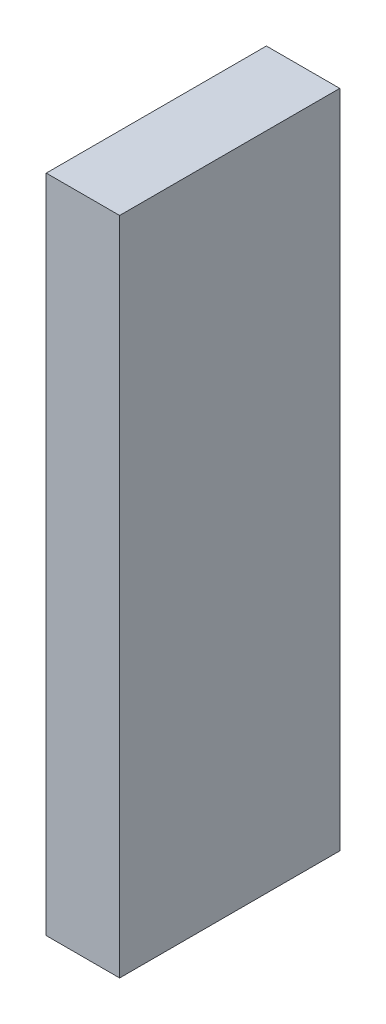
ISO-10303-21;
HEADER;
FILE_DESCRIPTION(('STEP AP214'),'2;1');
FILE_NAME('part.step','',(''),(''),'','','');
FILE_SCHEMA(('AUTOMOTIVE_DESIGN { 1 0 10303 214 1 1 1 1 }'));
ENDSEC;
DATA;
#1=APPLICATION_CONTEXT('core data for automotive mechanical design processes');
#2=APPLICATION_PROTOCOL_DEFINITION('international standard','automotive_design',2000,#1);
#3=PRODUCT_CONTEXT('',#1,'mechanical');
#4=PRODUCT('Part','Part','',(#3));
#5=PRODUCT_RELATED_PRODUCT_CATEGORY('part','',(#4));
#6=PRODUCT_DEFINITION_FORMATION('','',#4);
#7=PRODUCT_DEFINITION_CONTEXT('part definition',#1,'design');
#8=PRODUCT_DEFINITION('design','',#6,#7);
#9=PRODUCT_DEFINITION_SHAPE('','',#8);
#10=(LENGTH_UNIT() NAMED_UNIT(*) SI_UNIT(.MILLI.,.METRE.));
#11=(NAMED_UNIT(*) PLANE_ANGLE_UNIT() SI_UNIT($,.RADIAN.));
#12=(NAMED_UNIT(*) SI_UNIT($,.STERADIAN.) SOLID_ANGLE_UNIT());
#13=UNCERTAINTY_MEASURE_WITH_UNIT(LENGTH_MEASURE(1.E-05),#10,'distance_accuracy_value','');
#14=(GEOMETRIC_REPRESENTATION_CONTEXT(3) GLOBAL_UNCERTAINTY_ASSIGNED_CONTEXT((#13)) GLOBAL_UNIT_ASSIGNED_CONTEXT((#10,
#11,#12)) REPRESENTATION_CONTEXT('',''));
#15=CARTESIAN_POINT('',(0.,0.,0.));
#16=DIRECTION('',(0.,0.,1.));
#17=DIRECTION('',(1.,0.,0.));
#18=AXIS2_PLACEMENT_3D('',#15,#16,#17);
#19=CARTESIAN_POINT('',(3.175,-14.2875,-4.7625));
#20=DIRECTION('',(0.,0.,1.));
#21=DIRECTION('',(1.,0.,0.));
#22=AXIS2_PLACEMENT_3D('',#19,#20,#21);
#23=PLANE('',#22);
#24=DIRECTION('',(0.,1.,0.));
#25=VECTOR('',#24,1.);
#26=CARTESIAN_POINT('',(0.,-14.2875,-4.7625));
#27=LINE('',#26,#25);
#28=CARTESIAN_POINT('',(0.,-14.2875,-4.7625));
#29=VERTEX_POINT('',#28);
#30=CARTESIAN_POINT('',(0.,14.2875,-4.7625));
#31=VERTEX_POINT('',#30);
#32=EDGE_CURVE('E95',#29,#31,#27,.T.);
#33=ORIENTED_EDGE('',*,*,#32,.T.);
#34=DIRECTION('',(-1.,0.,0.));
#35=VECTOR('',#34,1.);
#36=CARTESIAN_POINT('',(3.175,14.2875,-4.7625));
#37=LINE('',#36,#35);
#38=CARTESIAN_POINT('',(3.175,14.2875,-4.7625));
#39=VERTEX_POINT('',#38);
#40=EDGE_CURVE('E11',#39,#31,#37,.T.);
#41=ORIENTED_EDGE('',*,*,#40,.F.);
#42=DIRECTION('',(0.,1.,0.));
#43=VECTOR('',#42,1.);
#44=CARTESIAN_POINT('',(3.175,-14.2875,-4.7625));
#45=LINE('',#44,#43);
#46=CARTESIAN_POINT('',(3.175,-14.2875,-4.7625));
#47=VERTEX_POINT('',#46);
#48=EDGE_CURVE('E83',#47,#39,#45,.T.);
#49=ORIENTED_EDGE('',*,*,#48,.F.);
#50=DIRECTION('',(-1.,0.,0.));
#51=VECTOR('',#50,1.);
#52=CARTESIAN_POINT('',(3.175,-14.2875,-4.7625));
#53=LINE('',#52,#51);
#54=EDGE_CURVE('E91',#47,#29,#53,.T.);
#55=ORIENTED_EDGE('',*,*,#54,.T.);
#56=EDGE_LOOP('',(#33,#41,#49,#55));
#57=FACE_BOUND('',#56,.T.);
#58=ADVANCED_FACE('F32',(#57),#23,.F.);
#59=CARTESIAN_POINT('',(3.175,14.2875,4.7625));
#60=DIRECTION('',(0.,-1.,0.));
#61=DIRECTION('',(0.,0.,-1.));
#62=AXIS2_PLACEMENT_3D('',#59,#60,#61);
#63=PLANE('',#62);
#64=DIRECTION('',(0.,0.,1.));
#65=VECTOR('',#64,1.);
#66=CARTESIAN_POINT('',(0.,14.2875,4.7625));
#67=LINE('',#66,#65);
#68=CARTESIAN_POINT('',(0.,14.2875,4.7625));
#69=VERTEX_POINT('',#68);
#70=EDGE_CURVE('E87',#31,#69,#67,.T.);
#71=ORIENTED_EDGE('',*,*,#70,.T.);
#72=DIRECTION('',(-1.,0.,0.));
#73=VECTOR('',#72,1.);
#74=CARTESIAN_POINT('',(3.175,14.2875,4.7625));
#75=LINE('',#74,#73);
#76=CARTESIAN_POINT('',(3.175,14.2875,4.7625));
#77=VERTEX_POINT('',#76);
#78=EDGE_CURVE('E40',#77,#69,#75,.T.);
#79=ORIENTED_EDGE('',*,*,#78,.F.);
#80=DIRECTION('',(0.,0.,1.));
#81=VECTOR('',#80,1.);
#82=CARTESIAN_POINT('',(3.175,14.2875,4.7625));
#83=LINE('',#82,#81);
#84=EDGE_CURVE('E78',#39,#77,#83,.T.);
#85=ORIENTED_EDGE('',*,*,#84,.F.);
#86=ORIENTED_EDGE('',*,*,#40,.T.);
#87=EDGE_LOOP('',(#71,#79,#85,#86));
#88=FACE_BOUND('',#87,.T.);
#89=ADVANCED_FACE('F86',(#88),#63,.F.);
#90=CARTESIAN_POINT('',(3.175,-14.2875,4.7625));
#91=DIRECTION('',(0.,0.,-1.));
#92=DIRECTION('',(-1.,0.,0.));
#93=AXIS2_PLACEMENT_3D('',#90,#91,#92);
#94=PLANE('',#93);
#95=DIRECTION('',(0.,-1.,0.));
#96=VECTOR('',#95,1.);
#97=CARTESIAN_POINT('',(0.,-14.2875,4.7625));
#98=LINE('',#97,#96);
#99=CARTESIAN_POINT('',(0.,-14.2875,4.7625));
#100=VERTEX_POINT('',#99);
#101=EDGE_CURVE('E65',#69,#100,#98,.T.);
#102=ORIENTED_EDGE('',*,*,#101,.T.);
#103=DIRECTION('',(-1.,0.,0.));
#104=VECTOR('',#103,1.);
#105=CARTESIAN_POINT('',(3.175,-14.2875,4.7625));
#106=LINE('',#105,#104);
#107=CARTESIAN_POINT('',(3.175,-14.2875,4.7625));
#108=VERTEX_POINT('',#107);
#109=EDGE_CURVE('E88',#108,#100,#106,.T.);
#110=ORIENTED_EDGE('',*,*,#109,.F.);
#111=DIRECTION('',(0.,-1.,0.));
#112=VECTOR('',#111,1.);
#113=CARTESIAN_POINT('',(3.175,-14.2875,4.7625));
#114=LINE('',#113,#112);
#115=EDGE_CURVE('E81',#77,#108,#114,.T.);
#116=ORIENTED_EDGE('',*,*,#115,.F.);
#117=ORIENTED_EDGE('',*,*,#78,.T.);
#118=EDGE_LOOP('',(#102,#110,#116,#117));
#119=FACE_BOUND('',#118,.T.);
#120=ADVANCED_FACE('F89',(#119),#94,.F.);
#121=CARTESIAN_POINT('',(3.175,-14.2875,4.7625));
#122=DIRECTION('',(0.,1.,0.));
#123=DIRECTION('',(0.,0.,1.));
#124=AXIS2_PLACEMENT_3D('',#121,#122,#123);
#125=PLANE('',#124);
#126=DIRECTION('',(0.,0.,-1.));
#127=VECTOR('',#126,1.);
#128=CARTESIAN_POINT('',(0.,-14.2875,4.7625));
#129=LINE('',#128,#127);
#130=EDGE_CURVE('E71',#100,#29,#129,.T.);
#131=ORIENTED_EDGE('',*,*,#130,.T.);
#132=ORIENTED_EDGE('',*,*,#54,.F.);
#133=DIRECTION('',(0.,0.,-1.));
#134=VECTOR('',#133,1.);
#135=CARTESIAN_POINT('',(3.175,-14.2875,4.7625));
#136=LINE('',#135,#134);
#137=EDGE_CURVE('E48',#108,#47,#136,.T.);
#138=ORIENTED_EDGE('',*,*,#137,.F.);
#139=ORIENTED_EDGE('',*,*,#109,.T.);
#140=EDGE_LOOP('',(#131,#132,#138,#139));
#141=FACE_BOUND('',#140,.T.);
#142=ADVANCED_FACE('F102',(#141),#125,.F.);
#143=CARTESIAN_POINT('',(3.175,14.2875,-4.7625));
#144=DIRECTION('',(-1.,0.,0.));
#145=DIRECTION('',(0.,0.,1.));
#146=AXIS2_PLACEMENT_3D('',#143,#144,#145);
#147=PLANE('',#146);
#148=ORIENTED_EDGE('',*,*,#48,.T.);
#149=ORIENTED_EDGE('',*,*,#84,.T.);
#150=ORIENTED_EDGE('',*,*,#115,.T.);
#151=ORIENTED_EDGE('',*,*,#137,.T.);
#152=EDGE_LOOP('',(#148,#149,#150,#151));
#153=FACE_BOUND('',#152,.T.);
#154=ADVANCED_FACE('F79',(#153),#147,.F.);
#155=CARTESIAN_POINT('',(0.,14.2875,-4.7625));
#156=DIRECTION('',(-1.,0.,0.));
#157=DIRECTION('',(0.,0.,1.));
#158=AXIS2_PLACEMENT_3D('',#155,#156,#157);
#159=PLANE('',#158);
#160=ORIENTED_EDGE('',*,*,#32,.F.);
#161=ORIENTED_EDGE('',*,*,#130,.F.);
#162=ORIENTED_EDGE('',*,*,#101,.F.);
#163=ORIENTED_EDGE('',*,*,#70,.F.);
#164=EDGE_LOOP('',(#160,#161,#162,#163));
#165=FACE_BOUND('',#164,.T.);
#166=ADVANCED_FACE('F105',(#165),#159,.T.);
#167=CLOSED_SHELL('',(#58,#89,#120,#142,#154,#166));
#168=MANIFOLD_SOLID_BREP('B2',#167);
#169=ADVANCED_BREP_SHAPE_REPRESENTATION('',(#18,#168),#14);
#170=SHAPE_DEFINITION_REPRESENTATION(#9,#169);
ENDSEC;
END-ISO-10303-21;
